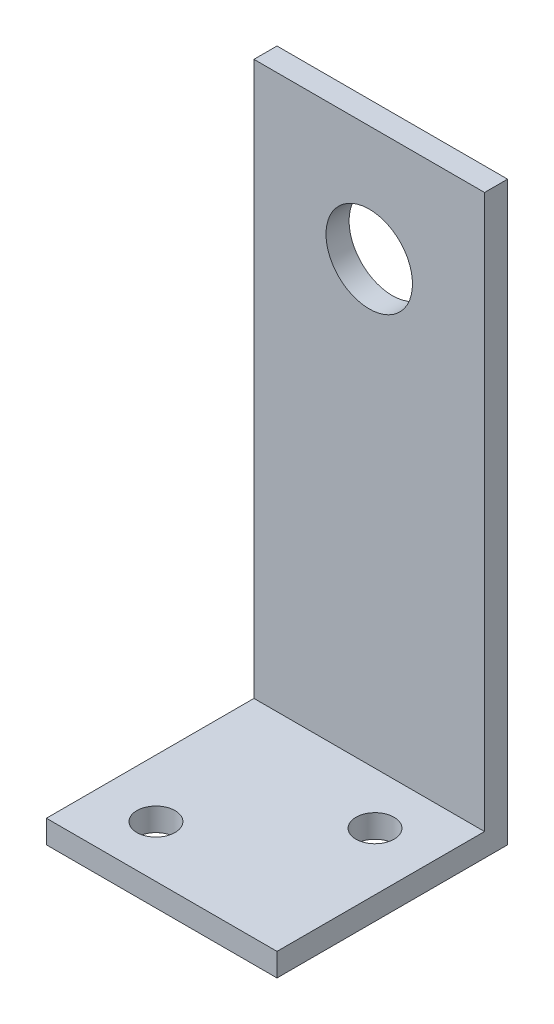
ISO-10303-21;
HEADER;
FILE_DESCRIPTION(('STEP AP214'),'2;1');
FILE_NAME('part.step','',(''),(''),'','','');
FILE_SCHEMA(('AUTOMOTIVE_DESIGN { 1 0 10303 214 1 1 1 1 }'));
ENDSEC;
DATA;
#1=APPLICATION_CONTEXT('core data for automotive mechanical design processes');
#2=APPLICATION_PROTOCOL_DEFINITION('international standard','automotive_design',2000,#1);
#3=PRODUCT_CONTEXT('',#1,'mechanical');
#4=PRODUCT('Part','Part','',(#3));
#5=PRODUCT_RELATED_PRODUCT_CATEGORY('part','',(#4));
#6=PRODUCT_DEFINITION_FORMATION('','',#4);
#7=PRODUCT_DEFINITION_CONTEXT('part definition',#1,'design');
#8=PRODUCT_DEFINITION('design','',#6,#7);
#9=PRODUCT_DEFINITION_SHAPE('','',#8);
#10=(LENGTH_UNIT() NAMED_UNIT(*) SI_UNIT(.MILLI.,.METRE.));
#11=(NAMED_UNIT(*) PLANE_ANGLE_UNIT() SI_UNIT($,.RADIAN.));
#12=(NAMED_UNIT(*) SI_UNIT($,.STERADIAN.) SOLID_ANGLE_UNIT());
#13=UNCERTAINTY_MEASURE_WITH_UNIT(LENGTH_MEASURE(1.E-05),#10,'distance_accuracy_value','');
#14=(GEOMETRIC_REPRESENTATION_CONTEXT(3) GLOBAL_UNCERTAINTY_ASSIGNED_CONTEXT((#13)) GLOBAL_UNIT_ASSIGNED_CONTEXT((#10,
#11,#12)) REPRESENTATION_CONTEXT('',''));
#15=CARTESIAN_POINT('',(0.,0.,0.));
#16=DIRECTION('',(0.,0.,1.));
#17=DIRECTION('',(1.,0.,0.));
#18=AXIS2_PLACEMENT_3D('',#15,#16,#17);
#19=CARTESIAN_POINT('',(-12.7,0.,25.4));
#20=DIRECTION('',(0.,0.,1.));
#21=DIRECTION('',(1.,0.,0.));
#22=AXIS2_PLACEMENT_3D('',#19,#20,#21);
#23=PLANE('',#22);
#24=DIRECTION('',(1.,0.,0.));
#25=VECTOR('',#24,1.);
#26=CARTESIAN_POINT('',(-12.7,0.,25.4));
#27=LINE('',#26,#25);
#28=CARTESIAN_POINT('',(-12.7,0.,25.4));
#29=VERTEX_POINT('',#28);
#30=CARTESIAN_POINT('',(12.7,0.,25.4));
#31=VERTEX_POINT('',#30);
#32=EDGE_CURVE('E93',#29,#31,#27,.T.);
#33=ORIENTED_EDGE('',*,*,#32,.T.);
#34=DIRECTION('',(0.,-1.,0.));
#35=VECTOR('',#34,1.);
#36=CARTESIAN_POINT('',(12.7,0.,25.4));
#37=LINE('',#36,#35);
#38=CARTESIAN_POINT('',(12.7,2.54,25.4));
#39=VERTEX_POINT('',#38);
#40=EDGE_CURVE('E96',#39,#31,#37,.T.);
#41=ORIENTED_EDGE('',*,*,#40,.F.);
#42=DIRECTION('',(1.,0.,0.));
#43=VECTOR('',#42,1.);
#44=CARTESIAN_POINT('',(-12.7,2.54,25.4));
#45=LINE('',#44,#43);
#46=CARTESIAN_POINT('',(-12.7,2.54,25.4));
#47=VERTEX_POINT('',#46);
#48=EDGE_CURVE('E11',#47,#39,#45,.T.);
#49=ORIENTED_EDGE('',*,*,#48,.F.);
#50=DIRECTION('',(0.,-1.,0.));
#51=VECTOR('',#50,1.);
#52=CARTESIAN_POINT('',(-12.7,0.,25.4));
#53=LINE('',#52,#51);
#54=EDGE_CURVE('E97',#47,#29,#53,.T.);
#55=ORIENTED_EDGE('',*,*,#54,.T.);
#56=EDGE_LOOP('',(#33,#41,#49,#55));
#57=FACE_BOUND('',#56,.T.);
#58=ADVANCED_FACE('F42',(#57),#23,.T.);
#59=CARTESIAN_POINT('',(-12.7,2.54,25.4));
#60=DIRECTION('',(0.,1.,0.));
#61=DIRECTION('',(0.,0.,1.));
#62=AXIS2_PLACEMENT_3D('',#59,#60,#61);
#63=PLANE('',#62);
#64=CARTESIAN_POINT('',(6.35,2.54,8.255));
#65=DIRECTION('',(0.,1.,0.));
#66=DIRECTION('',(0.,0.,1.));
#67=AXIS2_PLACEMENT_3D('',#64,#65,#66);
#68=CIRCLE('',#67,2.1);
#69=CARTESIAN_POINT('',(6.35,2.54,10.355));
#70=VERTEX_POINT('',#69);
#71=EDGE_CURVE('E215',#70,#70,#68,.T.);
#72=ORIENTED_EDGE('',*,*,#71,.F.);
#73=EDGE_LOOP('',(#72));
#74=FACE_BOUND('',#73,.T.);
#75=CARTESIAN_POINT('',(-6.34999999999999,2.54,19.685));
#76=DIRECTION('',(0.,1.,0.));
#77=DIRECTION('',(0.,0.,1.));
#78=AXIS2_PLACEMENT_3D('',#75,#76,#77);
#79=CIRCLE('',#78,2.1);
#80=CARTESIAN_POINT('',(-6.34999999999999,2.54,21.785));
#81=VERTEX_POINT('',#80);
#82=EDGE_CURVE('E212',#81,#81,#79,.T.);
#83=ORIENTED_EDGE('',*,*,#82,.F.);
#84=EDGE_LOOP('',(#83));
#85=FACE_BOUND('',#84,.T.);
#86=ORIENTED_EDGE('',*,*,#48,.T.);
#87=DIRECTION('',(0.,0.,1.));
#88=VECTOR('',#87,1.);
#89=CARTESIAN_POINT('',(12.7,2.54,25.4));
#90=LINE('',#89,#88);
#91=CARTESIAN_POINT('',(12.7,2.54,2.54));
#92=VERTEX_POINT('',#91);
#93=EDGE_CURVE('E116',#92,#39,#90,.T.);
#94=ORIENTED_EDGE('',*,*,#93,.F.);
#95=DIRECTION('',(1.,0.,0.));
#96=VECTOR('',#95,1.);
#97=CARTESIAN_POINT('',(-12.7,2.54,2.54));
#98=LINE('',#97,#96);
#99=CARTESIAN_POINT('',(-12.7,2.54,2.54));
#100=VERTEX_POINT('',#99);
#101=EDGE_CURVE('E51',#100,#92,#98,.T.);
#102=ORIENTED_EDGE('',*,*,#101,.F.);
#103=DIRECTION('',(0.,0.,1.));
#104=VECTOR('',#103,1.);
#105=CARTESIAN_POINT('',(-12.7,2.54,25.4));
#106=LINE('',#105,#104);
#107=EDGE_CURVE('E103',#100,#47,#106,.T.);
#108=ORIENTED_EDGE('',*,*,#107,.T.);
#109=EDGE_LOOP('',(#86,#94,#102,#108));
#110=FACE_BOUND('',#109,.T.);
#111=ADVANCED_FACE('F177',(#74,#85,#110),#63,.T.);
#112=CARTESIAN_POINT('',(-12.7,2.54,2.54));
#113=DIRECTION('',(0.,0.,1.));
#114=DIRECTION('',(0.,-1.,0.));
#115=AXIS2_PLACEMENT_3D('',#112,#113,#114);
#116=PLANE('',#115);
#117=CARTESIAN_POINT('',(0.,50.8,2.54));
#118=DIRECTION('',(0.,0.,1.));
#119=DIRECTION('',(1.,0.,0.));
#120=AXIS2_PLACEMENT_3D('',#117,#118,#119);
#121=CIRCLE('',#120,4.7625);
#122=CARTESIAN_POINT('',(4.7625,50.8,2.54));
#123=VERTEX_POINT('',#122);
#124=EDGE_CURVE('E121',#123,#123,#121,.T.);
#125=ORIENTED_EDGE('',*,*,#124,.F.);
#126=EDGE_LOOP('',(#125));
#127=FACE_BOUND('',#126,.T.);
#128=ORIENTED_EDGE('',*,*,#101,.T.);
#129=DIRECTION('',(0.,-1.,0.));
#130=VECTOR('',#129,1.);
#131=CARTESIAN_POINT('',(12.7,2.54,2.54));
#132=LINE('',#131,#130);
#133=CARTESIAN_POINT('',(12.7,63.5,2.54));
#134=VERTEX_POINT('',#133);
#135=EDGE_CURVE('E131',#134,#92,#132,.T.);
#136=ORIENTED_EDGE('',*,*,#135,.F.);
#137=DIRECTION('',(1.,0.,0.));
#138=VECTOR('',#137,1.);
#139=CARTESIAN_POINT('',(-12.7,63.5,2.54));
#140=LINE('',#139,#138);
#141=CARTESIAN_POINT('',(-12.7,63.5,2.54));
#142=VERTEX_POINT('',#141);
#143=EDGE_CURVE('E156',#142,#134,#140,.T.);
#144=ORIENTED_EDGE('',*,*,#143,.F.);
#145=DIRECTION('',(0.,-1.,0.));
#146=VECTOR('',#145,1.);
#147=CARTESIAN_POINT('',(-12.7,2.54,2.54));
#148=LINE('',#147,#146);
#149=EDGE_CURVE('E149',#142,#100,#148,.T.);
#150=ORIENTED_EDGE('',*,*,#149,.T.);
#151=EDGE_LOOP('',(#128,#136,#144,#150));
#152=FACE_BOUND('',#151,.T.);
#153=ADVANCED_FACE('F173',(#127,#152),#116,.T.);
#154=CARTESIAN_POINT('',(-12.7,63.5,2.54));
#155=DIRECTION('',(0.,1.,0.));
#156=DIRECTION('',(0.,0.,1.));
#157=AXIS2_PLACEMENT_3D('',#154,#155,#156);
#158=PLANE('',#157);
#159=ORIENTED_EDGE('',*,*,#143,.T.);
#160=DIRECTION('',(0.,0.,1.));
#161=VECTOR('',#160,1.);
#162=CARTESIAN_POINT('',(12.7,63.5,2.54));
#163=LINE('',#162,#161);
#164=CARTESIAN_POINT('',(12.7,63.5,0.));
#165=VERTEX_POINT('',#164);
#166=EDGE_CURVE('E127',#165,#134,#163,.T.);
#167=ORIENTED_EDGE('',*,*,#166,.F.);
#168=DIRECTION('',(1.,0.,0.));
#169=VECTOR('',#168,1.);
#170=CARTESIAN_POINT('',(-12.7,63.5,0.));
#171=LINE('',#170,#169);
#172=CARTESIAN_POINT('',(-12.7,63.5,0.));
#173=VERTEX_POINT('',#172);
#174=EDGE_CURVE('E159',#173,#165,#171,.T.);
#175=ORIENTED_EDGE('',*,*,#174,.F.);
#176=DIRECTION('',(0.,0.,1.));
#177=VECTOR('',#176,1.);
#178=CARTESIAN_POINT('',(-12.7,63.5,2.54));
#179=LINE('',#178,#177);
#180=EDGE_CURVE('E145',#173,#142,#179,.T.);
#181=ORIENTED_EDGE('',*,*,#180,.T.);
#182=EDGE_LOOP('',(#159,#167,#175,#181));
#183=FACE_BOUND('',#182,.T.);
#184=ADVANCED_FACE('F170',(#183),#158,.T.);
#185=CARTESIAN_POINT('',(-12.7,0.,0.));
#186=DIRECTION('',(0.,0.,-1.));
#187=DIRECTION('',(-1.,0.,0.));
#188=AXIS2_PLACEMENT_3D('',#185,#186,#187);
#189=PLANE('',#188);
#190=CARTESIAN_POINT('',(0.,50.8,0.));
#191=DIRECTION('',(0.,0.,-1.));
#192=DIRECTION('',(-1.,0.,0.));
#193=AXIS2_PLACEMENT_3D('',#190,#191,#192);
#194=CIRCLE('',#193,4.7625);
#195=CARTESIAN_POINT('',(-4.7625,50.8,0.));
#196=VERTEX_POINT('',#195);
#197=EDGE_CURVE('E45',#196,#196,#194,.T.);
#198=ORIENTED_EDGE('',*,*,#197,.F.);
#199=EDGE_LOOP('',(#198));
#200=FACE_BOUND('',#199,.T.);
#201=ORIENTED_EDGE('',*,*,#174,.T.);
#202=DIRECTION('',(0.,1.,0.));
#203=VECTOR('',#202,1.);
#204=CARTESIAN_POINT('',(12.7,0.,0.));
#205=LINE('',#204,#203);
#206=CARTESIAN_POINT('',(12.7,0.,0.));
#207=VERTEX_POINT('',#206);
#208=EDGE_CURVE('E111',#207,#165,#205,.T.);
#209=ORIENTED_EDGE('',*,*,#208,.F.);
#210=DIRECTION('',(1.,0.,0.));
#211=VECTOR('',#210,1.);
#212=CARTESIAN_POINT('',(-12.7,0.,0.));
#213=LINE('',#212,#211);
#214=CARTESIAN_POINT('',(-12.7,0.,0.));
#215=VERTEX_POINT('',#214);
#216=EDGE_CURVE('E102',#215,#207,#213,.T.);
#217=ORIENTED_EDGE('',*,*,#216,.F.);
#218=DIRECTION('',(0.,1.,0.));
#219=VECTOR('',#218,1.);
#220=CARTESIAN_POINT('',(-12.7,0.,0.));
#221=LINE('',#220,#219);
#222=EDGE_CURVE('E141',#215,#173,#221,.T.);
#223=ORIENTED_EDGE('',*,*,#222,.T.);
#224=EDGE_LOOP('',(#201,#209,#217,#223));
#225=FACE_BOUND('',#224,.T.);
#226=ADVANCED_FACE('F164',(#200,#225),#189,.T.);
#227=CARTESIAN_POINT('',(-12.7,0.,25.4));
#228=DIRECTION('',(0.,-1.,0.));
#229=DIRECTION('',(0.,0.,-1.));
#230=AXIS2_PLACEMENT_3D('',#227,#228,#229);
#231=PLANE('',#230);
#232=CARTESIAN_POINT('',(6.35,0.,8.255));
#233=DIRECTION('',(0.,1.,0.));
#234=DIRECTION('',(0.,0.,1.));
#235=AXIS2_PLACEMENT_3D('',#232,#233,#234);
#236=CIRCLE('',#235,2.1);
#237=CARTESIAN_POINT('',(6.35,0.,10.355));
#238=VERTEX_POINT('',#237);
#239=EDGE_CURVE('E206',#238,#238,#236,.T.);
#240=ORIENTED_EDGE('',*,*,#239,.T.);
#241=EDGE_LOOP('',(#240));
#242=FACE_BOUND('',#241,.T.);
#243=CARTESIAN_POINT('',(-6.34999999999999,0.,19.685));
#244=DIRECTION('',(0.,1.,0.));
#245=DIRECTION('',(0.,0.,1.));
#246=AXIS2_PLACEMENT_3D('',#243,#244,#245);
#247=CIRCLE('',#246,2.1);
#248=CARTESIAN_POINT('',(-6.34999999999999,0.,21.785));
#249=VERTEX_POINT('',#248);
#250=EDGE_CURVE('E209',#249,#249,#247,.T.);
#251=ORIENTED_EDGE('',*,*,#250,.T.);
#252=EDGE_LOOP('',(#251));
#253=FACE_BOUND('',#252,.T.);
#254=ORIENTED_EDGE('',*,*,#216,.T.);
#255=DIRECTION('',(0.,0.,-1.));
#256=VECTOR('',#255,1.);
#257=CARTESIAN_POINT('',(12.7,0.,25.4));
#258=LINE('',#257,#256);
#259=EDGE_CURVE('E105',#31,#207,#258,.T.);
#260=ORIENTED_EDGE('',*,*,#259,.F.);
#261=ORIENTED_EDGE('',*,*,#32,.F.);
#262=DIRECTION('',(0.,0.,-1.));
#263=VECTOR('',#262,1.);
#264=CARTESIAN_POINT('',(-12.7,0.,25.4));
#265=LINE('',#264,#263);
#266=EDGE_CURVE('E138',#29,#215,#265,.T.);
#267=ORIENTED_EDGE('',*,*,#266,.T.);
#268=EDGE_LOOP('',(#254,#260,#261,#267));
#269=FACE_BOUND('',#268,.T.);
#270=ADVANCED_FACE('F106',(#242,#253,#269),#231,.T.);
#271=CARTESIAN_POINT('',(-12.7,0.,0.));
#272=DIRECTION('',(-1.,0.,0.));
#273=DIRECTION('',(0.,0.,1.));
#274=AXIS2_PLACEMENT_3D('',#271,#272,#273);
#275=PLANE('',#274);
#276=ORIENTED_EDGE('',*,*,#54,.F.);
#277=ORIENTED_EDGE('',*,*,#107,.F.);
#278=ORIENTED_EDGE('',*,*,#149,.F.);
#279=ORIENTED_EDGE('',*,*,#180,.F.);
#280=ORIENTED_EDGE('',*,*,#222,.F.);
#281=ORIENTED_EDGE('',*,*,#266,.F.);
#282=EDGE_LOOP('',(#276,#277,#278,#279,#280,#281));
#283=FACE_BOUND('',#282,.T.);
#284=ADVANCED_FACE('F176',(#283),#275,.T.);
#285=CARTESIAN_POINT('',(12.7,0.,0.));
#286=DIRECTION('',(-1.,0.,0.));
#287=DIRECTION('',(0.,0.,1.));
#288=AXIS2_PLACEMENT_3D('',#285,#286,#287);
#289=PLANE('',#288);
#290=ORIENTED_EDGE('',*,*,#40,.T.);
#291=ORIENTED_EDGE('',*,*,#259,.T.);
#292=ORIENTED_EDGE('',*,*,#208,.T.);
#293=ORIENTED_EDGE('',*,*,#166,.T.);
#294=ORIENTED_EDGE('',*,*,#135,.T.);
#295=ORIENTED_EDGE('',*,*,#93,.T.);
#296=EDGE_LOOP('',(#290,#291,#292,#293,#294,#295));
#297=FACE_BOUND('',#296,.T.);
#298=ADVANCED_FACE('F114',(#297),#289,.F.);
#299=CARTESIAN_POINT('',(0.,50.8,-10.16));
#300=DIRECTION('',(0.,0.,1.));
#301=DIRECTION('',(1.,0.,0.));
#302=AXIS2_PLACEMENT_3D('',#299,#300,#301);
#303=CYLINDRICAL_SURFACE('',#302,4.7625);
#304=ORIENTED_EDGE('',*,*,#197,.T.);
#305=EDGE_LOOP('',(#304));
#306=FACE_BOUND('',#305,.T.);
#307=ORIENTED_EDGE('',*,*,#124,.T.);
#308=EDGE_LOOP('',(#307));
#309=FACE_BOUND('',#308,.T.);
#310=ADVANCED_FACE('F226',(#306,#309),#303,.F.);
#311=CARTESIAN_POINT('',(-6.34999999999999,0.,19.685));
#312=DIRECTION('',(0.,1.,0.));
#313=DIRECTION('',(0.,0.,1.));
#314=AXIS2_PLACEMENT_3D('',#311,#312,#313);
#315=CYLINDRICAL_SURFACE('',#314,2.1);
#316=ORIENTED_EDGE('',*,*,#250,.F.);
#317=EDGE_LOOP('',(#316));
#318=FACE_BOUND('',#317,.T.);
#319=ORIENTED_EDGE('',*,*,#82,.T.);
#320=EDGE_LOOP('',(#319));
#321=FACE_BOUND('',#320,.T.);
#322=ADVANCED_FACE('F228',(#318,#321),#315,.F.);
#323=CARTESIAN_POINT('',(6.35,0.,8.255));
#324=DIRECTION('',(0.,1.,0.));
#325=DIRECTION('',(0.,0.,1.));
#326=AXIS2_PLACEMENT_3D('',#323,#324,#325);
#327=CYLINDRICAL_SURFACE('',#326,2.1);
#328=ORIENTED_EDGE('',*,*,#239,.F.);
#329=EDGE_LOOP('',(#328));
#330=FACE_BOUND('',#329,.T.);
#331=ORIENTED_EDGE('',*,*,#71,.T.);
#332=EDGE_LOOP('',(#331));
#333=FACE_BOUND('',#332,.T.);
#334=ADVANCED_FACE('F234',(#330,#333),#327,.F.);
#335=CLOSED_SHELL('',(#58,#111,#153,#184,#226,#270,#284,#298,#310,#322,#334));
#336=MANIFOLD_SOLID_BREP('B2',#335);
#337=ADVANCED_BREP_SHAPE_REPRESENTATION('',(#18,#336),#14);
#338=SHAPE_DEFINITION_REPRESENTATION(#9,#337);
ENDSEC;
END-ISO-10303-21;
